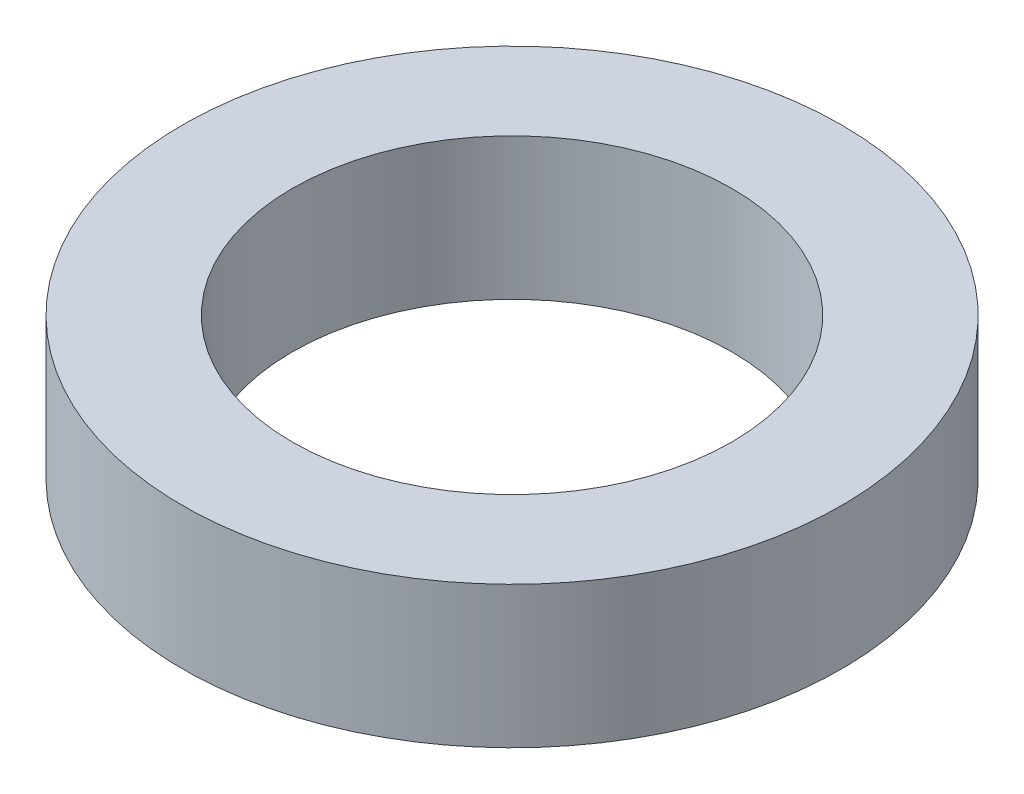
ISO-10303-21;
HEADER;
FILE_DESCRIPTION(('STEP AP214'),'2;1');
FILE_NAME('part.step','',(''),(''),'','','');
FILE_SCHEMA(('AUTOMOTIVE_DESIGN { 1 0 10303 214 1 1 1 1 }'));
ENDSEC;
DATA;
#1=APPLICATION_CONTEXT('core data for automotive mechanical design processes');
#2=APPLICATION_PROTOCOL_DEFINITION('international standard','automotive_design',2000,#1);
#3=PRODUCT_CONTEXT('',#1,'mechanical');
#4=PRODUCT('Part','Part','',(#3));
#5=PRODUCT_RELATED_PRODUCT_CATEGORY('part','',(#4));
#6=PRODUCT_DEFINITION_FORMATION('','',#4);
#7=PRODUCT_DEFINITION_CONTEXT('part definition',#1,'design');
#8=PRODUCT_DEFINITION('design','',#6,#7);
#9=PRODUCT_DEFINITION_SHAPE('','',#8);
#10=(LENGTH_UNIT() NAMED_UNIT(*) SI_UNIT(.MILLI.,.METRE.));
#11=(NAMED_UNIT(*) PLANE_ANGLE_UNIT() SI_UNIT($,.RADIAN.));
#12=(NAMED_UNIT(*) SI_UNIT($,.STERADIAN.) SOLID_ANGLE_UNIT());
#13=UNCERTAINTY_MEASURE_WITH_UNIT(LENGTH_MEASURE(1.E-05),#10,'distance_accuracy_value','');
#14=(GEOMETRIC_REPRESENTATION_CONTEXT(3) GLOBAL_UNCERTAINTY_ASSIGNED_CONTEXT((#13)) GLOBAL_UNIT_ASSIGNED_CONTEXT((#10,
#11,#12)) REPRESENTATION_CONTEXT('',''));
#15=CARTESIAN_POINT('',(0.,0.,0.));
#16=DIRECTION('',(0.,0.,1.));
#17=DIRECTION('',(1.,0.,0.));
#18=AXIS2_PLACEMENT_3D('',#15,#16,#17);
#19=CARTESIAN_POINT('',(0.,29.,0.));
#20=DIRECTION('',(0.,-1.,0.));
#21=DIRECTION('',(0.,0.,-1.));
#22=AXIS2_PLACEMENT_3D('',#19,#20,#21);
#23=CYLINDRICAL_SURFACE('',#22,67.5);
#24=CARTESIAN_POINT('',(0.,29.,0.));
#25=DIRECTION('',(0.,1.,0.));
#26=DIRECTION('',(0.,0.,1.));
#27=AXIS2_PLACEMENT_3D('',#24,#25,#26);
#28=CIRCLE('',#27,67.5);
#29=CARTESIAN_POINT('',(0.,29.,-67.5));
#30=VERTEX_POINT('',#29);
#31=EDGE_CURVE('E10',#30,#30,#28,.T.);
#32=CARTESIAN_POINT('',(0.,0.,0.));
#33=DIRECTION('',(0.,1.,0.));
#34=DIRECTION('',(0.,0.,1.));
#35=AXIS2_PLACEMENT_3D('',#32,#33,#34);
#36=CIRCLE('',#35,67.5);
#37=CARTESIAN_POINT('',(0.,0.,-67.5));
#38=VERTEX_POINT('',#37);
#39=EDGE_CURVE('E37',#38,#38,#36,.T.);
#40=CARTESIAN_POINT('',(0.,29.,-67.5));
#41=CARTESIAN_POINT('',(0.,28.6979166666667,-67.5));
#42=CARTESIAN_POINT('',(0.,28.3958333333333,-67.5));
#43=CARTESIAN_POINT('',(0.,27.7916666666667,-67.5));
#44=CARTESIAN_POINT('',(0.,27.4895833333333,-67.5));
#45=CARTESIAN_POINT('',(0.,26.8854166666667,-67.5));
#46=CARTESIAN_POINT('',(0.,26.5833333333333,-67.5));
#47=CARTESIAN_POINT('',(0.,25.9791666666667,-67.5));
#48=CARTESIAN_POINT('',(0.,25.6770833333333,-67.5));
#49=CARTESIAN_POINT('',(0.,25.0729166666667,-67.5));
#50=CARTESIAN_POINT('',(0.,24.7708333333333,-67.5));
#51=CARTESIAN_POINT('',(0.,24.1666666666667,-67.5));
#52=CARTESIAN_POINT('',(0.,23.8645833333333,-67.5));
#53=CARTESIAN_POINT('',(0.,23.2604166666667,-67.5));
#54=CARTESIAN_POINT('',(0.,22.9583333333333,-67.5));
#55=CARTESIAN_POINT('',(0.,22.3541666666667,-67.5));
#56=CARTESIAN_POINT('',(0.,22.0520833333333,-67.5));
#57=CARTESIAN_POINT('',(0.,21.4479166666667,-67.5));
#58=CARTESIAN_POINT('',(0.,21.1458333333333,-67.5));
#59=CARTESIAN_POINT('',(0.,20.5416666666667,-67.5));
#60=CARTESIAN_POINT('',(0.,20.2395833333333,-67.5));
#61=CARTESIAN_POINT('',(0.,19.6354166666667,-67.5));
#62=CARTESIAN_POINT('',(0.,19.3333333333333,-67.5));
#63=CARTESIAN_POINT('',(0.,18.7291666666667,-67.5));
#64=CARTESIAN_POINT('',(0.,18.4270833333333,-67.5));
#65=CARTESIAN_POINT('',(0.,17.8229166666667,-67.5));
#66=CARTESIAN_POINT('',(0.,17.5208333333333,-67.5));
#67=CARTESIAN_POINT('',(0.,16.9166666666667,-67.5));
#68=CARTESIAN_POINT('',(0.,16.6145833333333,-67.5));
#69=CARTESIAN_POINT('',(0.,16.0104166666667,-67.5));
#70=CARTESIAN_POINT('',(0.,15.7083333333333,-67.5));
#71=CARTESIAN_POINT('',(0.,15.1041666666667,-67.5));
#72=CARTESIAN_POINT('',(0.,14.8020833333333,-67.5));
#73=CARTESIAN_POINT('',(0.,14.1979166666667,-67.5));
#74=CARTESIAN_POINT('',(0.,13.8958333333333,-67.5));
#75=CARTESIAN_POINT('',(0.,13.2916666666667,-67.5));
#76=CARTESIAN_POINT('',(0.,12.9895833333333,-67.5));
#77=CARTESIAN_POINT('',(0.,12.3854166666667,-67.5));
#78=CARTESIAN_POINT('',(0.,12.0833333333333,-67.5));
#79=CARTESIAN_POINT('',(0.,11.4791666666667,-67.5));
#80=CARTESIAN_POINT('',(0.,11.1770833333333,-67.5));
#81=CARTESIAN_POINT('',(0.,10.5729166666667,-67.5));
#82=CARTESIAN_POINT('',(0.,10.2708333333333,-67.5));
#83=CARTESIAN_POINT('',(0.,9.66666666666667,-67.5));
#84=CARTESIAN_POINT('',(0.,9.36458333333333,-67.5));
#85=CARTESIAN_POINT('',(0.,8.76041666666667,-67.5));
#86=CARTESIAN_POINT('',(0.,8.45833333333333,-67.5));
#87=CARTESIAN_POINT('',(0.,7.85416666666667,-67.5));
#88=CARTESIAN_POINT('',(0.,7.55208333333333,-67.5));
#89=CARTESIAN_POINT('',(0.,6.94791666666667,-67.5));
#90=CARTESIAN_POINT('',(0.,6.64583333333333,-67.5));
#91=CARTESIAN_POINT('',(0.,6.04166666666667,-67.5));
#92=CARTESIAN_POINT('',(0.,5.73958333333333,-67.5));
#93=CARTESIAN_POINT('',(0.,5.13541666666667,-67.5));
#94=CARTESIAN_POINT('',(0.,4.83333333333333,-67.5));
#95=CARTESIAN_POINT('',(0.,4.22916666666667,-67.5));
#96=CARTESIAN_POINT('',(0.,3.92708333333333,-67.5));
#97=CARTESIAN_POINT('',(0.,3.32291666666667,-67.5));
#98=CARTESIAN_POINT('',(0.,3.02083333333333,-67.5));
#99=CARTESIAN_POINT('',(0.,2.41666666666667,-67.5));
#100=CARTESIAN_POINT('',(0.,2.11458333333333,-67.5));
#101=CARTESIAN_POINT('',(0.,1.51041666666667,-67.5));
#102=CARTESIAN_POINT('',(0.,1.20833333333333,-67.5));
#103=CARTESIAN_POINT('',(0.,0.604166666666667,-67.5));
#104=CARTESIAN_POINT('',(0.,0.302083333333333,-67.5));
#105=CARTESIAN_POINT('',(0.,0.,-67.5));
#106=B_SPLINE_CURVE_WITH_KNOTS('',3,(#40,#41,#42,#43,#44,#45,#46,#47,#48,#49,#50,#51,#52,#53,
#54,#55,#56,#57,#58,#59,#60,#61,#62,#63,#64,#65,#66,#67,#68,#69,#70,#71,#72,#73,#74,#75,#76,#77,
#78,#79,#80,#81,#82,#83,#84,#85,#86,#87,#88,#89,#90,#91,#92,#93,#94,#95,#96,#97,#98,#99,#100,
#101,#102,#103,#104,#105),.UNSPECIFIED.,.F.,.F.,(4,2,2,2,2,2,2,2,2,2,2,2,2,2,2,2,2,2,2,2,2,2,2,
2,2,2,2,2,2,2,2,2,4),(0.,0.906249999999997,1.8125,2.71875,3.625,4.53125,5.4375,6.34375,7.25,
8.15625,9.0625,9.96875,10.875,11.78125,12.6875,13.59375,14.5,15.40625,16.3125,17.21875,18.125,
19.03125,19.9375,20.84375,21.75,22.65625,23.5625,24.46875,25.375,26.28125,27.1875,28.09375,29.),.UNSPECIFIED.);
#107=EDGE_CURVE('BSEAM40',#30,#38,#106,.T.);
#108=ORIENTED_EDGE('',*,*,#31,.F.);
#109=ORIENTED_EDGE('',*,*,#39,.T.);
#110=ORIENTED_EDGE('',*,*,#107,.T.);
#111=ORIENTED_EDGE('',*,*,#107,.F.);
#112=EDGE_LOOP('',(#108,#110,#109,#111));
#113=FACE_BOUND('',#112,.T.);
#114=ADVANCED_FACE('F40',(#113),#23,.T.);
#115=CARTESIAN_POINT('',(0.,29.,0.));
#116=DIRECTION('',(0.,1.,0.));
#117=DIRECTION('',(0.,0.,1.));
#118=AXIS2_PLACEMENT_3D('',#115,#116,#117);
#119=PLANE('',#118);
#120=CARTESIAN_POINT('',(0.,29.,0.));
#121=DIRECTION('',(0.,1.,0.));
#122=DIRECTION('',(0.,0.,1.));
#123=AXIS2_PLACEMENT_3D('',#120,#121,#122);
#124=CIRCLE('',#123,45.);
#125=CARTESIAN_POINT('',(0.,29.,-45.));
#126=VERTEX_POINT('',#125);
#127=EDGE_CURVE('E50',#126,#126,#124,.T.);
#128=ORIENTED_EDGE('',*,*,#127,.F.);
#129=EDGE_LOOP('',(#128));
#130=FACE_BOUND('',#129,.T.);
#131=ORIENTED_EDGE('',*,*,#31,.T.);
#132=EDGE_LOOP('',(#131));
#133=FACE_BOUND('',#132,.T.);
#134=ADVANCED_FACE('F59',(#130,#133),#119,.T.);
#135=CARTESIAN_POINT('',(0.,0.,0.));
#136=DIRECTION('',(0.,1.,0.));
#137=DIRECTION('',(0.,0.,1.));
#138=AXIS2_PLACEMENT_3D('',#135,#136,#137);
#139=PLANE('',#138);
#140=CARTESIAN_POINT('',(0.,0.,0.));
#141=DIRECTION('',(0.,1.,0.));
#142=DIRECTION('',(0.,0.,1.));
#143=AXIS2_PLACEMENT_3D('',#140,#141,#142);
#144=CIRCLE('',#143,45.);
#145=CARTESIAN_POINT('',(0.,0.,-45.));
#146=VERTEX_POINT('',#145);
#147=EDGE_CURVE('E47',#146,#146,#144,.T.);
#148=ORIENTED_EDGE('',*,*,#147,.T.);
#149=EDGE_LOOP('',(#148));
#150=FACE_BOUND('',#149,.T.);
#151=ORIENTED_EDGE('',*,*,#39,.F.);
#152=EDGE_LOOP('',(#151));
#153=FACE_BOUND('',#152,.T.);
#154=ADVANCED_FACE('F58',(#150,#153),#139,.F.);
#155=CARTESIAN_POINT('',(0.,29.,0.));
#156=DIRECTION('',(0.,-1.,0.));
#157=DIRECTION('',(0.,0.,-1.));
#158=AXIS2_PLACEMENT_3D('',#155,#156,#157);
#159=CYLINDRICAL_SURFACE('',#158,45.);
#160=CARTESIAN_POINT('',(0.,29.,-45.));
#161=CARTESIAN_POINT('',(0.,28.6979166666667,-45.));
#162=CARTESIAN_POINT('',(0.,28.3958333333333,-45.));
#163=CARTESIAN_POINT('',(0.,27.7916666666667,-45.));
#164=CARTESIAN_POINT('',(0.,27.4895833333333,-45.));
#165=CARTESIAN_POINT('',(0.,26.8854166666667,-45.));
#166=CARTESIAN_POINT('',(0.,26.5833333333333,-45.));
#167=CARTESIAN_POINT('',(0.,25.9791666666667,-45.));
#168=CARTESIAN_POINT('',(0.,25.6770833333333,-45.));
#169=CARTESIAN_POINT('',(0.,25.0729166666667,-45.));
#170=CARTESIAN_POINT('',(0.,24.7708333333333,-45.));
#171=CARTESIAN_POINT('',(0.,24.1666666666667,-45.));
#172=CARTESIAN_POINT('',(0.,23.8645833333333,-45.));
#173=CARTESIAN_POINT('',(0.,23.2604166666667,-45.));
#174=CARTESIAN_POINT('',(0.,22.9583333333333,-45.));
#175=CARTESIAN_POINT('',(0.,22.3541666666667,-45.));
#176=CARTESIAN_POINT('',(0.,22.0520833333333,-45.));
#177=CARTESIAN_POINT('',(0.,21.4479166666667,-45.));
#178=CARTESIAN_POINT('',(0.,21.1458333333333,-45.));
#179=CARTESIAN_POINT('',(0.,20.5416666666667,-45.));
#180=CARTESIAN_POINT('',(0.,20.2395833333333,-45.));
#181=CARTESIAN_POINT('',(0.,19.6354166666667,-45.));
#182=CARTESIAN_POINT('',(0.,19.3333333333333,-45.));
#183=CARTESIAN_POINT('',(0.,18.7291666666667,-45.));
#184=CARTESIAN_POINT('',(0.,18.4270833333333,-45.));
#185=CARTESIAN_POINT('',(0.,17.8229166666667,-45.));
#186=CARTESIAN_POINT('',(0.,17.5208333333333,-45.));
#187=CARTESIAN_POINT('',(0.,16.9166666666667,-45.));
#188=CARTESIAN_POINT('',(0.,16.6145833333333,-45.));
#189=CARTESIAN_POINT('',(0.,16.0104166666667,-45.));
#190=CARTESIAN_POINT('',(0.,15.7083333333333,-45.));
#191=CARTESIAN_POINT('',(0.,15.1041666666667,-45.));
#192=CARTESIAN_POINT('',(0.,14.8020833333333,-45.));
#193=CARTESIAN_POINT('',(0.,14.1979166666667,-45.));
#194=CARTESIAN_POINT('',(0.,13.8958333333333,-45.));
#195=CARTESIAN_POINT('',(0.,13.2916666666667,-45.));
#196=CARTESIAN_POINT('',(0.,12.9895833333333,-45.));
#197=CARTESIAN_POINT('',(0.,12.3854166666667,-45.));
#198=CARTESIAN_POINT('',(0.,12.0833333333333,-45.));
#199=CARTESIAN_POINT('',(0.,11.4791666666667,-45.));
#200=CARTESIAN_POINT('',(0.,11.1770833333333,-45.));
#201=CARTESIAN_POINT('',(0.,10.5729166666667,-45.));
#202=CARTESIAN_POINT('',(0.,10.2708333333333,-45.));
#203=CARTESIAN_POINT('',(0.,9.66666666666667,-45.));
#204=CARTESIAN_POINT('',(0.,9.36458333333333,-45.));
#205=CARTESIAN_POINT('',(0.,8.76041666666667,-45.));
#206=CARTESIAN_POINT('',(0.,8.45833333333333,-45.));
#207=CARTESIAN_POINT('',(0.,7.85416666666667,-45.));
#208=CARTESIAN_POINT('',(0.,7.55208333333333,-45.));
#209=CARTESIAN_POINT('',(0.,6.94791666666667,-45.));
#210=CARTESIAN_POINT('',(0.,6.64583333333333,-45.));
#211=CARTESIAN_POINT('',(0.,6.04166666666667,-45.));
#212=CARTESIAN_POINT('',(0.,5.73958333333333,-45.));
#213=CARTESIAN_POINT('',(0.,5.13541666666667,-45.));
#214=CARTESIAN_POINT('',(0.,4.83333333333333,-45.));
#215=CARTESIAN_POINT('',(0.,4.22916666666667,-45.));
#216=CARTESIAN_POINT('',(0.,3.92708333333333,-45.));
#217=CARTESIAN_POINT('',(0.,3.32291666666667,-45.));
#218=CARTESIAN_POINT('',(0.,3.02083333333333,-45.));
#219=CARTESIAN_POINT('',(0.,2.41666666666667,-45.));
#220=CARTESIAN_POINT('',(0.,2.11458333333333,-45.));
#221=CARTESIAN_POINT('',(0.,1.51041666666667,-45.));
#222=CARTESIAN_POINT('',(0.,1.20833333333333,-45.));
#223=CARTESIAN_POINT('',(0.,0.604166666666667,-45.));
#224=CARTESIAN_POINT('',(0.,0.302083333333333,-45.));
#225=CARTESIAN_POINT('',(0.,0.,-45.));
#226=B_SPLINE_CURVE_WITH_KNOTS('',3,(#160,#161,#162,#163,#164,#165,#166,#167,#168,#169,#170,
#171,#172,#173,#174,#175,#176,#177,#178,#179,#180,#181,#182,#183,#184,#185,#186,#187,#188,#189,
#190,#191,#192,#193,#194,#195,#196,#197,#198,#199,#200,#201,#202,#203,#204,#205,#206,#207,#208,
#209,#210,#211,#212,#213,#214,#215,#216,#217,#218,#219,#220,#221,#222,#223,#224,#225),
.UNSPECIFIED.,.F.,.F.,(4,2,2,2,2,2,2,2,2,2,2,2,2,2,2,2,2,2,2,2,2,2,2,2,2,2,2,2,2,2,2,2,4),(0.,
0.906249999999997,1.8125,2.71875,3.625,4.53125,5.4375,6.34375,7.25,8.15625,9.0625,9.96875,
10.875,11.78125,12.6875,13.59375,14.5,15.40625,16.3125,17.21875,18.125,19.03125,19.9375,
20.84375,21.75,22.65625,23.5625,24.46875,25.375,26.28125,27.1875,28.09375,29.),.UNSPECIFIED.);
#227=EDGE_CURVE('BSEAM54',#126,#146,#226,.T.);
#228=ORIENTED_EDGE('',*,*,#127,.T.);
#229=ORIENTED_EDGE('',*,*,#147,.F.);
#230=ORIENTED_EDGE('',*,*,#227,.T.);
#231=ORIENTED_EDGE('',*,*,#227,.F.);
#232=EDGE_LOOP('',(#228,#230,#229,#231));
#233=FACE_BOUND('',#232,.T.);
#234=ADVANCED_FACE('F54',(#233),#159,.F.);
#235=CLOSED_SHELL('',(#114,#134,#154,#234));
#236=MANIFOLD_SOLID_BREP('B2',#235);
#237=ADVANCED_BREP_SHAPE_REPRESENTATION('',(#18,#236),#14);
#238=SHAPE_DEFINITION_REPRESENTATION(#9,#237);
ENDSEC;
END-ISO-10303-21;
